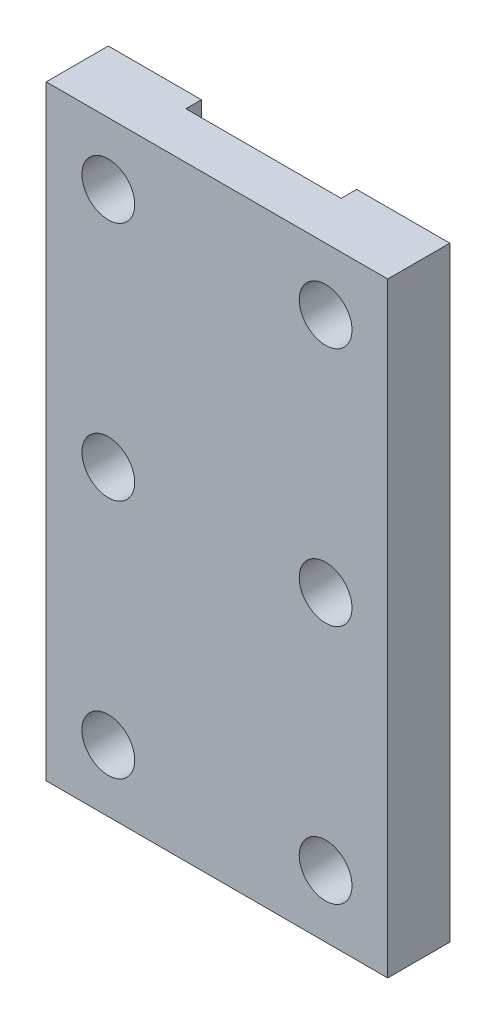
ISO-10303-21;
HEADER;
FILE_DESCRIPTION(('STEP AP214'),'2;1');
FILE_NAME('part.step','',(''),(''),'','','');
FILE_SCHEMA(('AUTOMOTIVE_DESIGN { 1 0 10303 214 1 1 1 1 }'));
ENDSEC;
DATA;
#1=APPLICATION_CONTEXT('core data for automotive mechanical design processes');
#2=APPLICATION_PROTOCOL_DEFINITION('international standard','automotive_design',2000,#1);
#3=PRODUCT_CONTEXT('',#1,'mechanical');
#4=PRODUCT('Part','Part','',(#3));
#5=PRODUCT_RELATED_PRODUCT_CATEGORY('part','',(#4));
#6=PRODUCT_DEFINITION_FORMATION('','',#4);
#7=PRODUCT_DEFINITION_CONTEXT('part definition',#1,'design');
#8=PRODUCT_DEFINITION('design','',#6,#7);
#9=PRODUCT_DEFINITION_SHAPE('','',#8);
#10=(LENGTH_UNIT() NAMED_UNIT(*) SI_UNIT(.MILLI.,.METRE.));
#11=(NAMED_UNIT(*) PLANE_ANGLE_UNIT() SI_UNIT($,.RADIAN.));
#12=(NAMED_UNIT(*) SI_UNIT($,.STERADIAN.) SOLID_ANGLE_UNIT());
#13=UNCERTAINTY_MEASURE_WITH_UNIT(LENGTH_MEASURE(1.E-05),#10,'distance_accuracy_value','');
#14=(GEOMETRIC_REPRESENTATION_CONTEXT(3) GLOBAL_UNCERTAINTY_ASSIGNED_CONTEXT((#13)) GLOBAL_UNIT_ASSIGNED_CONTEXT((#10,
#11,#12)) REPRESENTATION_CONTEXT('',''));
#15=CARTESIAN_POINT('',(0.,0.,0.));
#16=DIRECTION('',(0.,0.,1.));
#17=DIRECTION('',(1.,0.,0.));
#18=AXIS2_PLACEMENT_3D('',#15,#16,#17);
#19=CARTESIAN_POINT('',(0.,0.,0.));
#20=DIRECTION('',(0.,0.,1.));
#21=DIRECTION('',(1.,0.,0.));
#22=AXIS2_PLACEMENT_3D('',#19,#20,#21);
#23=PLANE('',#22);
#24=CARTESIAN_POINT('',(-7.,15.5,0.));
#25=DIRECTION('',(0.,0.,-1.));
#26=DIRECTION('',(-1.,0.,0.));
#27=AXIS2_PLACEMENT_3D('',#24,#25,#26);
#28=CIRCLE('',#27,1.7);
#29=CARTESIAN_POINT('',(-8.7,15.5,0.));
#30=VERTEX_POINT('',#29);
#31=EDGE_CURVE('E229',#30,#30,#28,.T.);
#32=ORIENTED_EDGE('',*,*,#31,.F.);
#33=EDGE_LOOP('',(#32));
#34=FACE_BOUND('',#33,.T.);
#35=CARTESIAN_POINT('',(-7.,0.,0.));
#36=DIRECTION('',(0.,0.,-1.));
#37=DIRECTION('',(-1.,0.,0.));
#38=AXIS2_PLACEMENT_3D('',#35,#36,#37);
#39=CIRCLE('',#38,1.7);
#40=CARTESIAN_POINT('',(-8.7,0.,0.));
#41=VERTEX_POINT('',#40);
#42=EDGE_CURVE('E245',#41,#41,#39,.T.);
#43=ORIENTED_EDGE('',*,*,#42,.F.);
#44=EDGE_LOOP('',(#43));
#45=FACE_BOUND('',#44,.T.);
#46=CARTESIAN_POINT('',(-7.,-15.5,0.));
#47=DIRECTION('',(0.,0.,-1.));
#48=DIRECTION('',(-1.,0.,0.));
#49=AXIS2_PLACEMENT_3D('',#46,#47,#48);
#50=CIRCLE('',#49,1.7);
#51=CARTESIAN_POINT('',(-8.7,-15.5,0.));
#52=VERTEX_POINT('',#51);
#53=EDGE_CURVE('E239',#52,#52,#50,.T.);
#54=ORIENTED_EDGE('',*,*,#53,.F.);
#55=EDGE_LOOP('',(#54));
#56=FACE_BOUND('',#55,.T.);
#57=DIRECTION('',(-1.,0.,0.));
#58=VECTOR('',#57,1.);
#59=CARTESIAN_POINT('',(-11.,19.5,0.));
#60=LINE('',#59,#58);
#61=CARTESIAN_POINT('',(-5.,19.5,0.));
#62=VERTEX_POINT('',#61);
#63=CARTESIAN_POINT('',(-11.,19.5,0.));
#64=VERTEX_POINT('',#63);
#65=EDGE_CURVE('E158',#62,#64,#60,.T.);
#66=ORIENTED_EDGE('',*,*,#65,.F.);
#67=DIRECTION('',(0.,1.,0.));
#68=VECTOR('',#67,1.);
#69=CARTESIAN_POINT('',(-5.,-19.5,0.));
#70=LINE('',#69,#68);
#71=CARTESIAN_POINT('',(-5.,-19.5,0.));
#72=VERTEX_POINT('',#71);
#73=EDGE_CURVE('E143',#72,#62,#70,.T.);
#74=ORIENTED_EDGE('',*,*,#73,.F.);
#75=DIRECTION('',(1.,0.,0.));
#76=VECTOR('',#75,1.);
#77=CARTESIAN_POINT('',(-11.,-19.5,0.));
#78=LINE('',#77,#76);
#79=CARTESIAN_POINT('',(-11.,-19.5,0.));
#80=VERTEX_POINT('',#79);
#81=EDGE_CURVE('E131',#80,#72,#78,.T.);
#82=ORIENTED_EDGE('',*,*,#81,.F.);
#83=DIRECTION('',(0.,-1.,0.));
#84=VECTOR('',#83,1.);
#85=CARTESIAN_POINT('',(-11.,19.5,0.));
#86=LINE('',#85,#84);
#87=EDGE_CURVE('E162',#64,#80,#86,.T.);
#88=ORIENTED_EDGE('',*,*,#87,.F.);
#89=EDGE_LOOP('',(#66,#74,#82,#88));
#90=FACE_BOUND('',#89,.T.);
#91=ADVANCED_FACE('F35',(#34,#45,#56,#90),#23,.F.);
#92=CARTESIAN_POINT('',(11.,19.5,4.));
#93=DIRECTION('',(-1.,0.,0.));
#94=DIRECTION('',(0.,-1.,0.));
#95=AXIS2_PLACEMENT_3D('',#92,#93,#94);
#96=PLANE('',#95);
#97=DIRECTION('',(0.,1.,0.));
#98=VECTOR('',#97,1.);
#99=CARTESIAN_POINT('',(11.,19.5,0.));
#100=LINE('',#99,#98);
#101=CARTESIAN_POINT('',(11.,-19.5,0.));
#102=VERTEX_POINT('',#101);
#103=CARTESIAN_POINT('',(11.,19.5,0.));
#104=VERTEX_POINT('',#103);
#105=EDGE_CURVE('E145',#102,#104,#100,.T.);
#106=ORIENTED_EDGE('',*,*,#105,.T.);
#107=DIRECTION('',(0.,0.,-1.));
#108=VECTOR('',#107,1.);
#109=CARTESIAN_POINT('',(11.,19.5,4.));
#110=LINE('',#109,#108);
#111=CARTESIAN_POINT('',(11.,19.5,4.));
#112=VERTEX_POINT('',#111);
#113=EDGE_CURVE('E11',#112,#104,#110,.T.);
#114=ORIENTED_EDGE('',*,*,#113,.F.);
#115=DIRECTION('',(0.,1.,0.));
#116=VECTOR('',#115,1.);
#117=CARTESIAN_POINT('',(11.,19.5,4.));
#118=LINE('',#117,#116);
#119=CARTESIAN_POINT('',(11.,-19.5,4.));
#120=VERTEX_POINT('',#119);
#121=EDGE_CURVE('E149',#120,#112,#118,.T.);
#122=ORIENTED_EDGE('',*,*,#121,.F.);
#123=DIRECTION('',(0.,0.,-1.));
#124=VECTOR('',#123,1.);
#125=CARTESIAN_POINT('',(11.,-19.5,4.));
#126=LINE('',#125,#124);
#127=EDGE_CURVE('E155',#120,#102,#126,.T.);
#128=ORIENTED_EDGE('',*,*,#127,.T.);
#129=EDGE_LOOP('',(#106,#114,#122,#128));
#130=FACE_BOUND('',#129,.T.);
#131=ADVANCED_FACE('F37',(#130),#96,.F.);
#132=CARTESIAN_POINT('',(-11.,19.5,4.));
#133=DIRECTION('',(0.,-1.,0.));
#134=DIRECTION('',(0.,0.,-1.));
#135=AXIS2_PLACEMENT_3D('',#132,#133,#134);
#136=PLANE('',#135);
#137=DIRECTION('',(1.,0.,0.));
#138=VECTOR('',#137,1.);
#139=CARTESIAN_POINT('',(-5.,19.5,1.));
#140=LINE('',#139,#138);
#141=CARTESIAN_POINT('',(-5.,19.5,1.));
#142=VERTEX_POINT('',#141);
#143=CARTESIAN_POINT('',(5.,19.5,1.));
#144=VERTEX_POINT('',#143);
#145=EDGE_CURVE('E133',#142,#144,#140,.T.);
#146=ORIENTED_EDGE('',*,*,#145,.F.);
#147=DIRECTION('',(0.,0.,1.));
#148=VECTOR('',#147,1.);
#149=CARTESIAN_POINT('',(-5.,19.5,0.));
#150=LINE('',#149,#148);
#151=EDGE_CURVE('E115',#62,#142,#150,.T.);
#152=ORIENTED_EDGE('',*,*,#151,.F.);
#153=ORIENTED_EDGE('',*,*,#65,.T.);
#154=DIRECTION('',(0.,0.,-1.));
#155=VECTOR('',#154,1.);
#156=CARTESIAN_POINT('',(-11.,19.5,4.));
#157=LINE('',#156,#155);
#158=CARTESIAN_POINT('',(-11.,19.5,4.));
#159=VERTEX_POINT('',#158);
#160=EDGE_CURVE('E43',#159,#64,#157,.T.);
#161=ORIENTED_EDGE('',*,*,#160,.F.);
#162=DIRECTION('',(-1.,0.,0.));
#163=VECTOR('',#162,1.);
#164=CARTESIAN_POINT('',(-11.,19.5,4.));
#165=LINE('',#164,#163);
#166=EDGE_CURVE('E87',#112,#159,#165,.T.);
#167=ORIENTED_EDGE('',*,*,#166,.F.);
#168=ORIENTED_EDGE('',*,*,#113,.T.);
#169=CARTESIAN_POINT('',(5.,19.5,0.));
#170=VERTEX_POINT('',#169);
#171=EDGE_CURVE('E159',#104,#170,#60,.T.);
#172=ORIENTED_EDGE('',*,*,#171,.T.);
#173=DIRECTION('',(0.,0.,-1.));
#174=VECTOR('',#173,1.);
#175=CARTESIAN_POINT('',(5.,19.5,0.));
#176=LINE('',#175,#174);
#177=EDGE_CURVE('E50',#144,#170,#176,.T.);
#178=ORIENTED_EDGE('',*,*,#177,.F.);
#179=EDGE_LOOP('',(#146,#152,#153,#161,#167,#168,#172,#178));
#180=FACE_BOUND('',#179,.T.);
#181=ADVANCED_FACE('F175',(#180),#136,.F.);
#182=CARTESIAN_POINT('',(-11.,19.5,4.));
#183=DIRECTION('',(1.,0.,0.));
#184=DIRECTION('',(0.,1.,0.));
#185=AXIS2_PLACEMENT_3D('',#182,#183,#184);
#186=PLANE('',#185);
#187=ORIENTED_EDGE('',*,*,#87,.T.);
#188=DIRECTION('',(0.,0.,-1.));
#189=VECTOR('',#188,1.);
#190=CARTESIAN_POINT('',(-11.,-19.5,4.));
#191=LINE('',#190,#189);
#192=CARTESIAN_POINT('',(-11.,-19.5,4.));
#193=VERTEX_POINT('',#192);
#194=EDGE_CURVE('E166',#193,#80,#191,.T.);
#195=ORIENTED_EDGE('',*,*,#194,.F.);
#196=DIRECTION('',(0.,-1.,0.));
#197=VECTOR('',#196,1.);
#198=CARTESIAN_POINT('',(-11.,19.5,4.));
#199=LINE('',#198,#197);
#200=EDGE_CURVE('E152',#159,#193,#199,.T.);
#201=ORIENTED_EDGE('',*,*,#200,.F.);
#202=ORIENTED_EDGE('',*,*,#160,.T.);
#203=EDGE_LOOP('',(#187,#195,#201,#202));
#204=FACE_BOUND('',#203,.T.);
#205=ADVANCED_FACE('F171',(#204),#186,.F.);
#206=CARTESIAN_POINT('',(-11.,-19.5,4.));
#207=DIRECTION('',(0.,1.,0.));
#208=DIRECTION('',(0.,0.,1.));
#209=AXIS2_PLACEMENT_3D('',#206,#207,#208);
#210=PLANE('',#209);
#211=ORIENTED_EDGE('',*,*,#81,.T.);
#212=DIRECTION('',(0.,0.,1.));
#213=VECTOR('',#212,1.);
#214=CARTESIAN_POINT('',(-5.,-19.5,0.));
#215=LINE('',#214,#213);
#216=CARTESIAN_POINT('',(-5.,-19.5,1.));
#217=VERTEX_POINT('',#216);
#218=EDGE_CURVE('E112',#72,#217,#215,.T.);
#219=ORIENTED_EDGE('',*,*,#218,.T.);
#220=DIRECTION('',(1.,0.,0.));
#221=VECTOR('',#220,1.);
#222=CARTESIAN_POINT('',(-5.,-19.5,1.));
#223=LINE('',#222,#221);
#224=CARTESIAN_POINT('',(5.,-19.5,1.));
#225=VERTEX_POINT('',#224);
#226=EDGE_CURVE('E123',#217,#225,#223,.T.);
#227=ORIENTED_EDGE('',*,*,#226,.T.);
#228=DIRECTION('',(0.,0.,-1.));
#229=VECTOR('',#228,1.);
#230=CARTESIAN_POINT('',(5.,-19.5,0.));
#231=LINE('',#230,#229);
#232=CARTESIAN_POINT('',(5.,-19.5,0.));
#233=VERTEX_POINT('',#232);
#234=EDGE_CURVE('E120',#225,#233,#231,.T.);
#235=ORIENTED_EDGE('',*,*,#234,.T.);
#236=EDGE_CURVE('E80',#233,#102,#78,.T.);
#237=ORIENTED_EDGE('',*,*,#236,.T.);
#238=ORIENTED_EDGE('',*,*,#127,.F.);
#239=DIRECTION('',(1.,0.,0.));
#240=VECTOR('',#239,1.);
#241=CARTESIAN_POINT('',(-11.,-19.5,4.));
#242=LINE('',#241,#240);
#243=EDGE_CURVE('E59',#193,#120,#242,.T.);
#244=ORIENTED_EDGE('',*,*,#243,.F.);
#245=ORIENTED_EDGE('',*,*,#194,.T.);
#246=EDGE_LOOP('',(#211,#219,#227,#235,#237,#238,#244,#245));
#247=FACE_BOUND('',#246,.T.);
#248=ADVANCED_FACE('F128',(#247),#210,.F.);
#249=CARTESIAN_POINT('',(0.,0.,4.));
#250=DIRECTION('',(0.,0.,1.));
#251=DIRECTION('',(1.,0.,0.));
#252=AXIS2_PLACEMENT_3D('',#249,#250,#251);
#253=PLANE('',#252);
#254=CARTESIAN_POINT('',(7.,-15.5,4.));
#255=DIRECTION('',(0.,0.,-1.));
#256=DIRECTION('',(-1.,0.,0.));
#257=AXIS2_PLACEMENT_3D('',#254,#255,#256);
#258=CIRCLE('',#257,1.7);
#259=CARTESIAN_POINT('',(5.3,-15.5,4.));
#260=VERTEX_POINT('',#259);
#261=EDGE_CURVE('E226',#260,#260,#258,.T.);
#262=ORIENTED_EDGE('',*,*,#261,.T.);
#263=EDGE_LOOP('',(#262));
#264=FACE_BOUND('',#263,.T.);
#265=CARTESIAN_POINT('',(-7.,15.5,4.));
#266=DIRECTION('',(0.,0.,-1.));
#267=DIRECTION('',(-1.,0.,0.));
#268=AXIS2_PLACEMENT_3D('',#265,#266,#267);
#269=CIRCLE('',#268,1.7);
#270=CARTESIAN_POINT('',(-8.7,15.5,4.));
#271=VERTEX_POINT('',#270);
#272=EDGE_CURVE('E232',#271,#271,#269,.T.);
#273=ORIENTED_EDGE('',*,*,#272,.T.);
#274=EDGE_LOOP('',(#273));
#275=FACE_BOUND('',#274,.T.);
#276=CARTESIAN_POINT('',(-7.,0.,4.));
#277=DIRECTION('',(0.,0.,-1.));
#278=DIRECTION('',(-1.,0.,0.));
#279=AXIS2_PLACEMENT_3D('',#276,#277,#278);
#280=CIRCLE('',#279,1.7);
#281=CARTESIAN_POINT('',(-8.7,0.,4.));
#282=VERTEX_POINT('',#281);
#283=EDGE_CURVE('E233',#282,#282,#280,.T.);
#284=ORIENTED_EDGE('',*,*,#283,.T.);
#285=EDGE_LOOP('',(#284));
#286=FACE_BOUND('',#285,.T.);
#287=CARTESIAN_POINT('',(-7.,-15.5,4.));
#288=DIRECTION('',(0.,0.,-1.));
#289=DIRECTION('',(-1.,0.,0.));
#290=AXIS2_PLACEMENT_3D('',#287,#288,#289);
#291=CIRCLE('',#290,1.7);
#292=CARTESIAN_POINT('',(-8.7,-15.5,4.));
#293=VERTEX_POINT('',#292);
#294=EDGE_CURVE('E242',#293,#293,#291,.T.);
#295=ORIENTED_EDGE('',*,*,#294,.T.);
#296=EDGE_LOOP('',(#295));
#297=FACE_BOUND('',#296,.T.);
#298=CARTESIAN_POINT('',(7.,0.,4.));
#299=DIRECTION('',(0.,0.,-1.));
#300=DIRECTION('',(-1.,0.,0.));
#301=AXIS2_PLACEMENT_3D('',#298,#299,#300);
#302=CIRCLE('',#301,1.7);
#303=CARTESIAN_POINT('',(5.3,0.,4.));
#304=VERTEX_POINT('',#303);
#305=EDGE_CURVE('E220',#304,#304,#302,.T.);
#306=ORIENTED_EDGE('',*,*,#305,.T.);
#307=EDGE_LOOP('',(#306));
#308=FACE_BOUND('',#307,.T.);
#309=CARTESIAN_POINT('',(7.,15.5,4.));
#310=DIRECTION('',(0.,0.,-1.));
#311=DIRECTION('',(-1.,0.,0.));
#312=AXIS2_PLACEMENT_3D('',#309,#310,#311);
#313=CIRCLE('',#312,1.7);
#314=CARTESIAN_POINT('',(5.3,15.5,4.));
#315=VERTEX_POINT('',#314);
#316=EDGE_CURVE('E141',#315,#315,#313,.T.);
#317=ORIENTED_EDGE('',*,*,#316,.T.);
#318=EDGE_LOOP('',(#317));
#319=FACE_BOUND('',#318,.T.);
#320=ORIENTED_EDGE('',*,*,#121,.T.);
#321=ORIENTED_EDGE('',*,*,#166,.T.);
#322=ORIENTED_EDGE('',*,*,#200,.T.);
#323=ORIENTED_EDGE('',*,*,#243,.T.);
#324=EDGE_LOOP('',(#320,#321,#322,#323));
#325=FACE_BOUND('',#324,.T.);
#326=ADVANCED_FACE('F203',(#264,#275,#286,#297,#308,#319,#325),#253,.T.);
#327=CARTESIAN_POINT('',(7.,-15.5,0.));
#328=DIRECTION('',(0.,0.,-1.));
#329=DIRECTION('',(-1.,0.,0.));
#330=AXIS2_PLACEMENT_3D('',#327,#328,#329);
#331=CIRCLE('',#330,1.7);
#332=CARTESIAN_POINT('',(5.3,-15.5,0.));
#333=VERTEX_POINT('',#332);
#334=EDGE_CURVE('E212',#333,#333,#331,.T.);
#335=ORIENTED_EDGE('',*,*,#334,.F.);
#336=EDGE_LOOP('',(#335));
#337=FACE_BOUND('',#336,.T.);
#338=CARTESIAN_POINT('',(7.,0.,0.));
#339=DIRECTION('',(0.,0.,-1.));
#340=DIRECTION('',(-1.,0.,0.));
#341=AXIS2_PLACEMENT_3D('',#338,#339,#340);
#342=CIRCLE('',#341,1.7);
#343=CARTESIAN_POINT('',(5.3,0.,0.));
#344=VERTEX_POINT('',#343);
#345=EDGE_CURVE('E216',#344,#344,#342,.T.);
#346=ORIENTED_EDGE('',*,*,#345,.F.);
#347=EDGE_LOOP('',(#346));
#348=FACE_BOUND('',#347,.T.);
#349=CARTESIAN_POINT('',(7.,15.5,0.));
#350=DIRECTION('',(0.,0.,-1.));
#351=DIRECTION('',(-1.,0.,0.));
#352=AXIS2_PLACEMENT_3D('',#349,#350,#351);
#353=CIRCLE('',#352,1.7);
#354=CARTESIAN_POINT('',(5.3,15.5,0.));
#355=VERTEX_POINT('',#354);
#356=EDGE_CURVE('E136',#355,#355,#353,.T.);
#357=ORIENTED_EDGE('',*,*,#356,.F.);
#358=EDGE_LOOP('',(#357));
#359=FACE_BOUND('',#358,.T.);
#360=ORIENTED_EDGE('',*,*,#236,.F.);
#361=DIRECTION('',(0.,1.,0.));
#362=VECTOR('',#361,1.);
#363=CARTESIAN_POINT('',(5.,-19.5,0.));
#364=LINE('',#363,#362);
#365=EDGE_CURVE('E146',#233,#170,#364,.T.);
#366=ORIENTED_EDGE('',*,*,#365,.T.);
#367=ORIENTED_EDGE('',*,*,#171,.F.);
#368=ORIENTED_EDGE('',*,*,#105,.F.);
#369=EDGE_LOOP('',(#360,#366,#367,#368));
#370=FACE_BOUND('',#369,.T.);
#371=ADVANCED_FACE('F179',(#337,#348,#359,#370),#23,.F.);
#372=CARTESIAN_POINT('',(-5.,-19.5,0.));
#373=DIRECTION('',(-1.,0.,0.));
#374=DIRECTION('',(0.,0.,1.));
#375=AXIS2_PLACEMENT_3D('',#372,#373,#374);
#376=PLANE('',#375);
#377=ORIENTED_EDGE('',*,*,#151,.T.);
#378=DIRECTION('',(0.,1.,0.));
#379=VECTOR('',#378,1.);
#380=CARTESIAN_POINT('',(-5.,-19.5,1.));
#381=LINE('',#380,#379);
#382=EDGE_CURVE('E108',#217,#142,#381,.T.);
#383=ORIENTED_EDGE('',*,*,#382,.F.);
#384=ORIENTED_EDGE('',*,*,#218,.F.);
#385=ORIENTED_EDGE('',*,*,#73,.T.);
#386=EDGE_LOOP('',(#377,#383,#384,#385));
#387=FACE_BOUND('',#386,.T.);
#388=ADVANCED_FACE('F110',(#387),#376,.F.);
#389=CARTESIAN_POINT('',(5.,-19.5,0.));
#390=DIRECTION('',(1.,0.,0.));
#391=DIRECTION('',(0.,0.,-1.));
#392=AXIS2_PLACEMENT_3D('',#389,#390,#391);
#393=PLANE('',#392);
#394=ORIENTED_EDGE('',*,*,#177,.T.);
#395=ORIENTED_EDGE('',*,*,#365,.F.);
#396=ORIENTED_EDGE('',*,*,#234,.F.);
#397=DIRECTION('',(0.,1.,0.));
#398=VECTOR('',#397,1.);
#399=CARTESIAN_POINT('',(5.,-19.5,1.));
#400=LINE('',#399,#398);
#401=EDGE_CURVE('E119',#225,#144,#400,.T.);
#402=ORIENTED_EDGE('',*,*,#401,.T.);
#403=EDGE_LOOP('',(#394,#395,#396,#402));
#404=FACE_BOUND('',#403,.T.);
#405=ADVANCED_FACE('F180',(#404),#393,.F.);
#406=CARTESIAN_POINT('',(-5.,-19.5,1.));
#407=DIRECTION('',(0.,0.,1.));
#408=DIRECTION('',(1.,0.,0.));
#409=AXIS2_PLACEMENT_3D('',#406,#407,#408);
#410=PLANE('',#409);
#411=ORIENTED_EDGE('',*,*,#145,.T.);
#412=ORIENTED_EDGE('',*,*,#401,.F.);
#413=ORIENTED_EDGE('',*,*,#226,.F.);
#414=ORIENTED_EDGE('',*,*,#382,.T.);
#415=EDGE_LOOP('',(#411,#412,#413,#414));
#416=FACE_BOUND('',#415,.T.);
#417=ADVANCED_FACE('F124',(#416),#410,.F.);
#418=CARTESIAN_POINT('',(7.,15.5,4.));
#419=DIRECTION('',(0.,0.,-1.));
#420=DIRECTION('',(-1.,0.,0.));
#421=AXIS2_PLACEMENT_3D('',#418,#419,#420);
#422=CYLINDRICAL_SURFACE('',#421,1.7);
#423=ORIENTED_EDGE('',*,*,#316,.F.);
#424=EDGE_LOOP('',(#423));
#425=FACE_BOUND('',#424,.T.);
#426=ORIENTED_EDGE('',*,*,#356,.T.);
#427=EDGE_LOOP('',(#426));
#428=FACE_BOUND('',#427,.T.);
#429=ADVANCED_FACE('F187',(#425,#428),#422,.F.);
#430=CARTESIAN_POINT('',(7.,0.,4.));
#431=DIRECTION('',(0.,0.,-1.));
#432=DIRECTION('',(-1.,0.,0.));
#433=AXIS2_PLACEMENT_3D('',#430,#431,#432);
#434=CYLINDRICAL_SURFACE('',#433,1.7);
#435=ORIENTED_EDGE('',*,*,#305,.F.);
#436=EDGE_LOOP('',(#435));
#437=FACE_BOUND('',#436,.T.);
#438=ORIENTED_EDGE('',*,*,#345,.T.);
#439=EDGE_LOOP('',(#438));
#440=FACE_BOUND('',#439,.T.);
#441=ADVANCED_FACE('F270',(#437,#440),#434,.F.);
#442=CARTESIAN_POINT('',(7.,-15.5,4.));
#443=DIRECTION('',(0.,0.,-1.));
#444=DIRECTION('',(-1.,0.,0.));
#445=AXIS2_PLACEMENT_3D('',#442,#443,#444);
#446=CYLINDRICAL_SURFACE('',#445,1.7);
#447=ORIENTED_EDGE('',*,*,#261,.F.);
#448=EDGE_LOOP('',(#447));
#449=FACE_BOUND('',#448,.T.);
#450=ORIENTED_EDGE('',*,*,#334,.T.);
#451=EDGE_LOOP('',(#450));
#452=FACE_BOUND('',#451,.T.);
#453=ADVANCED_FACE('F264',(#449,#452),#446,.F.);
#454=CARTESIAN_POINT('',(-7.,-15.5,4.));
#455=DIRECTION('',(0.,0.,-1.));
#456=DIRECTION('',(-1.,0.,0.));
#457=AXIS2_PLACEMENT_3D('',#454,#455,#456);
#458=CYLINDRICAL_SURFACE('',#457,1.7);
#459=ORIENTED_EDGE('',*,*,#294,.F.);
#460=EDGE_LOOP('',(#459));
#461=FACE_BOUND('',#460,.T.);
#462=ORIENTED_EDGE('',*,*,#53,.T.);
#463=EDGE_LOOP('',(#462));
#464=FACE_BOUND('',#463,.T.);
#465=ADVANCED_FACE('F257',(#461,#464),#458,.F.);
#466=CARTESIAN_POINT('',(-7.,0.,4.));
#467=DIRECTION('',(0.,0.,-1.));
#468=DIRECTION('',(-1.,0.,0.));
#469=AXIS2_PLACEMENT_3D('',#466,#467,#468);
#470=CYLINDRICAL_SURFACE('',#469,1.7);
#471=ORIENTED_EDGE('',*,*,#283,.F.);
#472=EDGE_LOOP('',(#471));
#473=FACE_BOUND('',#472,.T.);
#474=ORIENTED_EDGE('',*,*,#42,.T.);
#475=EDGE_LOOP('',(#474));
#476=FACE_BOUND('',#475,.T.);
#477=ADVANCED_FACE('F253',(#473,#476),#470,.F.);
#478=CARTESIAN_POINT('',(-7.,15.5,4.));
#479=DIRECTION('',(0.,0.,-1.));
#480=DIRECTION('',(-1.,0.,0.));
#481=AXIS2_PLACEMENT_3D('',#478,#479,#480);
#482=CYLINDRICAL_SURFACE('',#481,1.7);
#483=ORIENTED_EDGE('',*,*,#272,.F.);
#484=EDGE_LOOP('',(#483));
#485=FACE_BOUND('',#484,.T.);
#486=ORIENTED_EDGE('',*,*,#31,.T.);
#487=EDGE_LOOP('',(#486));
#488=FACE_BOUND('',#487,.T.);
#489=ADVANCED_FACE('F256',(#485,#488),#482,.F.);
#490=CLOSED_SHELL('',(#91,#131,#181,#205,#248,#326,#371,#388,#405,#417,#429,#441,#453,#465,#477,#489));
#491=MANIFOLD_SOLID_BREP('B2',#490);
#492=ADVANCED_BREP_SHAPE_REPRESENTATION('',(#18,#491),#14);
#493=SHAPE_DEFINITION_REPRESENTATION(#9,#492);
ENDSEC;
END-ISO-10303-21;
